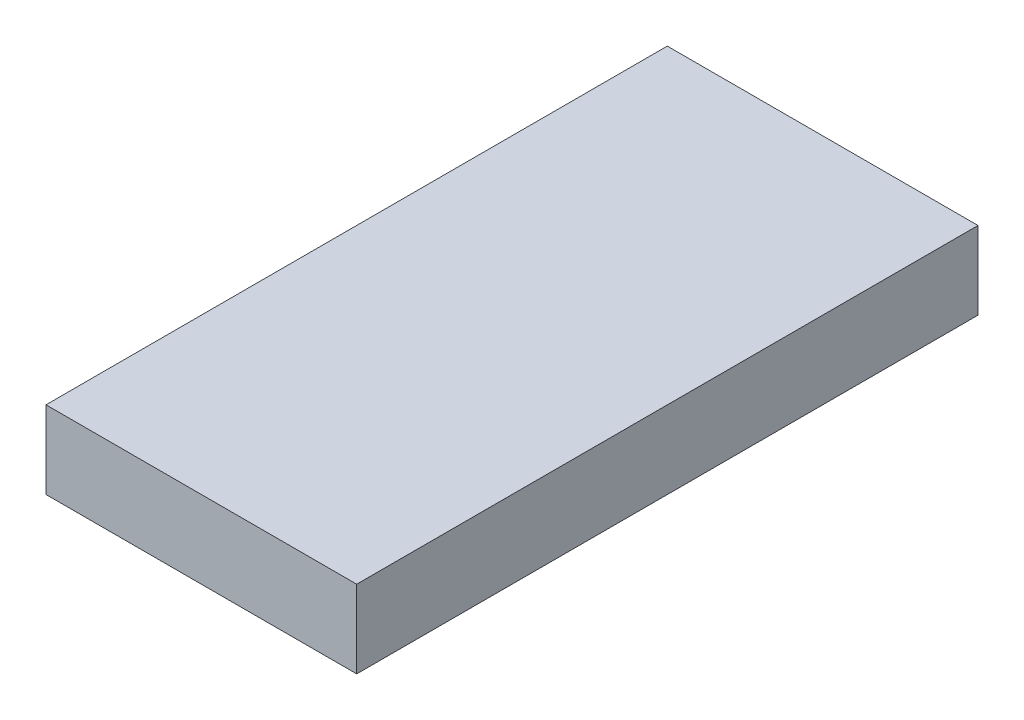
ISO-10303-21;
HEADER;
FILE_DESCRIPTION(('STEP AP214'),'2;1');
FILE_NAME('part.step','',(''),(''),'','','');
FILE_SCHEMA(('AUTOMOTIVE_DESIGN { 1 0 10303 214 1 1 1 1 }'));
ENDSEC;
DATA;
#1=APPLICATION_CONTEXT('core data for automotive mechanical design processes');
#2=APPLICATION_PROTOCOL_DEFINITION('international standard','automotive_design',2000,#1);
#3=PRODUCT_CONTEXT('',#1,'mechanical');
#4=PRODUCT('Part','Part','',(#3));
#5=PRODUCT_RELATED_PRODUCT_CATEGORY('part','',(#4));
#6=PRODUCT_DEFINITION_FORMATION('','',#4);
#7=PRODUCT_DEFINITION_CONTEXT('part definition',#1,'design');
#8=PRODUCT_DEFINITION('design','',#6,#7);
#9=PRODUCT_DEFINITION_SHAPE('','',#8);
#10=(LENGTH_UNIT() NAMED_UNIT(*) SI_UNIT(.MILLI.,.METRE.));
#11=(NAMED_UNIT(*) PLANE_ANGLE_UNIT() SI_UNIT($,.RADIAN.));
#12=(NAMED_UNIT(*) SI_UNIT($,.STERADIAN.) SOLID_ANGLE_UNIT());
#13=UNCERTAINTY_MEASURE_WITH_UNIT(LENGTH_MEASURE(1.E-05),#10,'distance_accuracy_value','');
#14=(GEOMETRIC_REPRESENTATION_CONTEXT(3) GLOBAL_UNCERTAINTY_ASSIGNED_CONTEXT((#13)) GLOBAL_UNIT_ASSIGNED_CONTEXT((#10,
#11,#12)) REPRESENTATION_CONTEXT('',''));
#15=CARTESIAN_POINT('',(0.,0.,0.));
#16=DIRECTION('',(0.,0.,1.));
#17=DIRECTION('',(1.,0.,0.));
#18=AXIS2_PLACEMENT_3D('',#15,#16,#17);
#19=CARTESIAN_POINT('',(0.,1.269999998498E-06,1.20000014));
#20=DIRECTION('',(0.,0.,1.));
#21=DIRECTION('',(1.,0.,0.));
#22=AXIS2_PLACEMENT_3D('',#19,#20,#21);
#23=PLANE('',#22);
#24=DIRECTION('',(0.,-1.,0.));
#25=VECTOR('',#24,1.);
#26=CARTESIAN_POINT('',(-0.30004004,0.07504176,1.20000014));
#27=LINE('',#26,#25);
#28=CARTESIAN_POINT('',(-0.30004004,0.07504176,1.20000014));
#29=VERTEX_POINT('',#28);
#30=CARTESIAN_POINT('',(-0.30004004,-0.07503922000001,1.20000014));
#31=VERTEX_POINT('',#30);
#32=EDGE_CURVE('E80',#29,#31,#27,.T.);
#33=ORIENTED_EDGE('',*,*,#32,.T.);
#34=DIRECTION('',(1.,0.,0.));
#35=VECTOR('',#34,1.);
#36=CARTESIAN_POINT('',(-0.30004004,-0.07503922000001,1.20000014));
#37=LINE('',#36,#35);
#38=CARTESIAN_POINT('',(0.30004004,-0.07503922000001,1.20000014));
#39=VERTEX_POINT('',#38);
#40=EDGE_CURVE('E85',#31,#39,#37,.T.);
#41=ORIENTED_EDGE('',*,*,#40,.T.);
#42=DIRECTION('',(0.,1.,0.));
#43=VECTOR('',#42,1.);
#44=CARTESIAN_POINT('',(0.30004004,-0.07503922000001,1.20000014));
#45=LINE('',#44,#43);
#46=CARTESIAN_POINT('',(0.30004004,0.07504176,1.20000014));
#47=VERTEX_POINT('',#46);
#48=EDGE_CURVE('E110',#39,#47,#45,.T.);
#49=ORIENTED_EDGE('',*,*,#48,.T.);
#50=DIRECTION('',(-1.,0.,0.));
#51=VECTOR('',#50,1.);
#52=CARTESIAN_POINT('',(0.30004004,0.07504176,1.20000014));
#53=LINE('',#52,#51);
#54=EDGE_CURVE('E11',#47,#29,#53,.T.);
#55=ORIENTED_EDGE('',*,*,#54,.T.);
#56=EDGE_LOOP('',(#33,#41,#49,#55));
#57=FACE_BOUND('',#56,.T.);
#58=ADVANCED_FACE('F16',(#57),#23,.T.);
#59=CARTESIAN_POINT('',(0.,1.269999998498E-06,0.));
#60=DIRECTION('',(0.,0.,1.));
#61=DIRECTION('',(1.,0.,0.));
#62=AXIS2_PLACEMENT_3D('',#59,#60,#61);
#63=PLANE('',#62);
#64=DIRECTION('',(0.,-1.,0.));
#65=VECTOR('',#64,1.);
#66=CARTESIAN_POINT('',(-0.30004004,0.07504176,0.));
#67=LINE('',#66,#65);
#68=CARTESIAN_POINT('',(-0.30004004,0.07504176,0.));
#69=VERTEX_POINT('',#68);
#70=CARTESIAN_POINT('',(-0.30004004,-0.07503922000001,0.));
#71=VERTEX_POINT('',#70);
#72=EDGE_CURVE('E71',#69,#71,#67,.T.);
#73=ORIENTED_EDGE('',*,*,#72,.F.);
#74=DIRECTION('',(-1.,0.,0.));
#75=VECTOR('',#74,1.);
#76=CARTESIAN_POINT('',(0.30004004,0.07504176,0.));
#77=LINE('',#76,#75);
#78=CARTESIAN_POINT('',(0.30004004,0.07504176,0.));
#79=VERTEX_POINT('',#78);
#80=EDGE_CURVE('E20',#79,#69,#77,.T.);
#81=ORIENTED_EDGE('',*,*,#80,.F.);
#82=DIRECTION('',(0.,1.,0.));
#83=VECTOR('',#82,1.);
#84=CARTESIAN_POINT('',(0.30004004,-0.07503922000001,0.));
#85=LINE('',#84,#83);
#86=CARTESIAN_POINT('',(0.30004004,-0.07503922000001,0.));
#87=VERTEX_POINT('',#86);
#88=EDGE_CURVE('E74',#87,#79,#85,.T.);
#89=ORIENTED_EDGE('',*,*,#88,.F.);
#90=DIRECTION('',(1.,0.,0.));
#91=VECTOR('',#90,1.);
#92=CARTESIAN_POINT('',(-0.30004004,-0.07503922000001,0.));
#93=LINE('',#92,#91);
#94=EDGE_CURVE('E68',#71,#87,#93,.T.);
#95=ORIENTED_EDGE('',*,*,#94,.F.);
#96=EDGE_LOOP('',(#73,#81,#89,#95));
#97=FACE_BOUND('',#96,.T.);
#98=ADVANCED_FACE('F18',(#97),#63,.F.);
#99=CARTESIAN_POINT('',(0.30004004,0.07504176,0.));
#100=DIRECTION('',(0.,-1.,0.));
#101=DIRECTION('',(0.,0.,-1.));
#102=AXIS2_PLACEMENT_3D('',#99,#100,#101);
#103=PLANE('',#102);
#104=DIRECTION('',(0.,0.,1.));
#105=VECTOR('',#104,1.);
#106=CARTESIAN_POINT('',(0.30004004,0.07504176,0.));
#107=LINE('',#106,#105);
#108=EDGE_CURVE('E106',#79,#47,#107,.T.);
#109=ORIENTED_EDGE('',*,*,#108,.F.);
#110=ORIENTED_EDGE('',*,*,#80,.T.);
#111=DIRECTION('',(0.,0.,1.));
#112=VECTOR('',#111,1.);
#113=CARTESIAN_POINT('',(-0.30004004,0.07504176,0.));
#114=LINE('',#113,#112);
#115=EDGE_CURVE('E92',#69,#29,#114,.T.);
#116=ORIENTED_EDGE('',*,*,#115,.T.);
#117=ORIENTED_EDGE('',*,*,#54,.F.);
#118=EDGE_LOOP('',(#109,#110,#116,#117));
#119=FACE_BOUND('',#118,.T.);
#120=ADVANCED_FACE('F118',(#119),#103,.F.);
#121=CARTESIAN_POINT('',(0.30004004,-0.07503922000001,0.));
#122=DIRECTION('',(-1.,0.,0.));
#123=DIRECTION('',(0.,0.,1.));
#124=AXIS2_PLACEMENT_3D('',#121,#122,#123);
#125=PLANE('',#124);
#126=DIRECTION('',(0.,0.,1.));
#127=VECTOR('',#126,1.);
#128=CARTESIAN_POINT('',(0.30004004,-0.07503922000001,0.));
#129=LINE('',#128,#127);
#130=EDGE_CURVE('E79',#87,#39,#129,.T.);
#131=ORIENTED_EDGE('',*,*,#130,.F.);
#132=ORIENTED_EDGE('',*,*,#88,.T.);
#133=ORIENTED_EDGE('',*,*,#108,.T.);
#134=ORIENTED_EDGE('',*,*,#48,.F.);
#135=EDGE_LOOP('',(#131,#132,#133,#134));
#136=FACE_BOUND('',#135,.T.);
#137=ADVANCED_FACE('F120',(#136),#125,.F.);
#138=CARTESIAN_POINT('',(-0.30004004,-0.07503922000001,0.));
#139=DIRECTION('',(0.,1.,0.));
#140=DIRECTION('',(1.,0.,0.));
#141=AXIS2_PLACEMENT_3D('',#138,#139,#140);
#142=PLANE('',#141);
#143=DIRECTION('',(0.,0.,1.));
#144=VECTOR('',#143,1.);
#145=CARTESIAN_POINT('',(-0.30004004,-0.07503922000001,0.));
#146=LINE('',#145,#144);
#147=EDGE_CURVE('E82',#71,#31,#146,.T.);
#148=ORIENTED_EDGE('',*,*,#147,.F.);
#149=ORIENTED_EDGE('',*,*,#94,.T.);
#150=ORIENTED_EDGE('',*,*,#130,.T.);
#151=ORIENTED_EDGE('',*,*,#40,.F.);
#152=EDGE_LOOP('',(#148,#149,#150,#151));
#153=FACE_BOUND('',#152,.T.);
#154=ADVANCED_FACE('F83',(#153),#142,.F.);
#155=CARTESIAN_POINT('',(-0.30004004,0.07504176,0.));
#156=DIRECTION('',(1.,0.,0.));
#157=DIRECTION('',(0.,1.,0.));
#158=AXIS2_PLACEMENT_3D('',#155,#156,#157);
#159=PLANE('',#158);
#160=ORIENTED_EDGE('',*,*,#115,.F.);
#161=ORIENTED_EDGE('',*,*,#72,.T.);
#162=ORIENTED_EDGE('',*,*,#147,.T.);
#163=ORIENTED_EDGE('',*,*,#32,.F.);
#164=EDGE_LOOP('',(#160,#161,#162,#163));
#165=FACE_BOUND('',#164,.T.);
#166=ADVANCED_FACE('F91',(#165),#159,.F.);
#167=CLOSED_SHELL('',(#58,#98,#120,#137,#154,#166));
#168=MANIFOLD_SOLID_BREP('B1',#167);
#169=ADVANCED_BREP_SHAPE_REPRESENTATION('',(#18,#168),#14);
#170=SHAPE_DEFINITION_REPRESENTATION(#9,#169);
ENDSEC;
END-ISO-10303-21;
